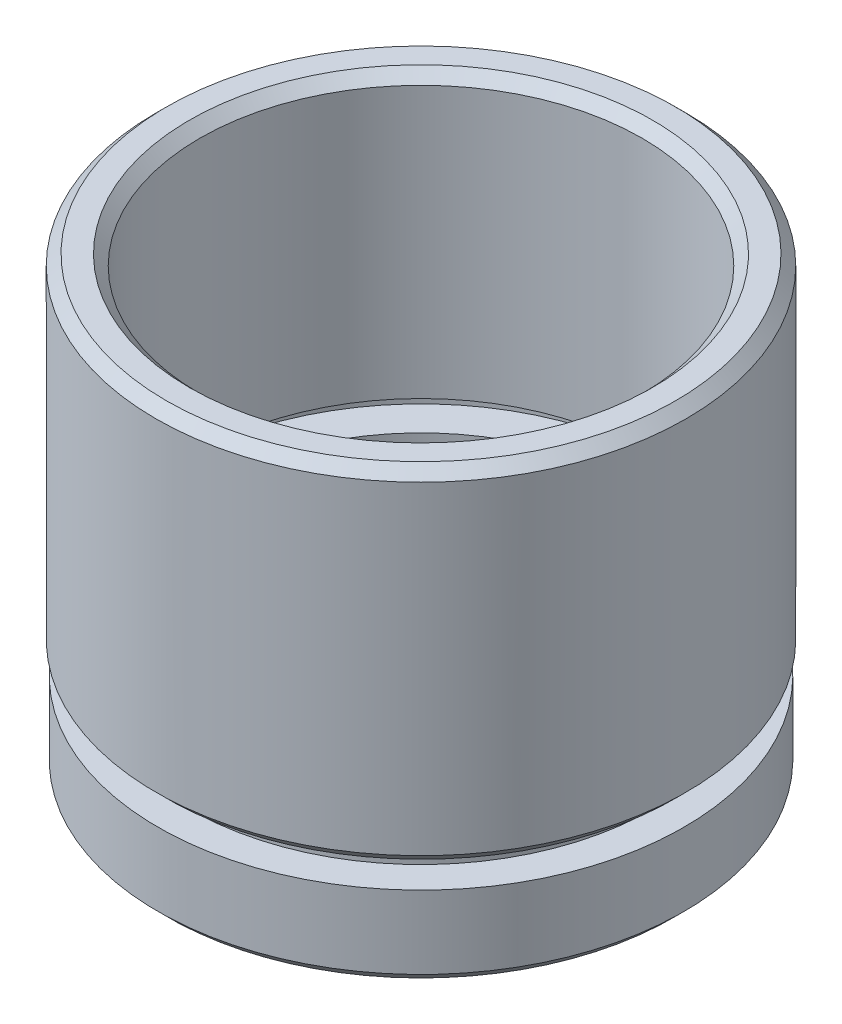
ISO-10303-21;
HEADER;
FILE_DESCRIPTION(('STEP AP214'),'2;1');
FILE_NAME('part.step','',(''),(''),'','','');
FILE_SCHEMA(('AUTOMOTIVE_DESIGN { 1 0 10303 214 1 1 1 1 }'));
ENDSEC;
DATA;
#1=APPLICATION_CONTEXT('core data for automotive mechanical design processes');
#2=APPLICATION_PROTOCOL_DEFINITION('international standard','automotive_design',2000,#1);
#3=PRODUCT_CONTEXT('',#1,'mechanical');
#4=PRODUCT('Part','Part','',(#3));
#5=PRODUCT_RELATED_PRODUCT_CATEGORY('part','',(#4));
#6=PRODUCT_DEFINITION_FORMATION('','',#4);
#7=PRODUCT_DEFINITION_CONTEXT('part definition',#1,'design');
#8=PRODUCT_DEFINITION('design','',#6,#7);
#9=PRODUCT_DEFINITION_SHAPE('','',#8);
#10=(LENGTH_UNIT() NAMED_UNIT(*) SI_UNIT(.MILLI.,.METRE.));
#11=(NAMED_UNIT(*) PLANE_ANGLE_UNIT() SI_UNIT($,.RADIAN.));
#12=(NAMED_UNIT(*) SI_UNIT($,.STERADIAN.) SOLID_ANGLE_UNIT());
#13=UNCERTAINTY_MEASURE_WITH_UNIT(LENGTH_MEASURE(1.E-05),#10,'distance_accuracy_value','');
#14=(GEOMETRIC_REPRESENTATION_CONTEXT(3) GLOBAL_UNCERTAINTY_ASSIGNED_CONTEXT((#13)) GLOBAL_UNIT_ASSIGNED_CONTEXT((#10,
#11,#12)) REPRESENTATION_CONTEXT('',''));
#15=CARTESIAN_POINT('',(0.,0.,0.));
#16=DIRECTION('',(0.,0.,1.));
#17=DIRECTION('',(1.,0.,0.));
#18=AXIS2_PLACEMENT_3D('',#15,#16,#17);
#19=CARTESIAN_POINT('',(0.,0.,0.));
#20=DIRECTION('',(0.,-1.,0.));
#21=DIRECTION('',(0.,0.,-1.));
#22=AXIS2_PLACEMENT_3D('',#19,#20,#21);
#23=CYLINDRICAL_SURFACE('',#22,9.25);
#24=CARTESIAN_POINT('',(0.,0.,0.));
#25=DIRECTION('',(0.,-1.,0.));
#26=DIRECTION('',(0.,0.,-1.));
#27=AXIS2_PLACEMENT_3D('',#24,#25,#26);
#28=CIRCLE('',#27,9.25);
#29=CARTESIAN_POINT('',(0.,0.,-9.25));
#30=VERTEX_POINT('',#29);
#31=EDGE_CURVE('E67',#30,#30,#28,.T.);
#32=ORIENTED_EDGE('',*,*,#31,.T.);
#33=EDGE_LOOP('',(#32));
#34=FACE_BOUND('',#33,.T.);
#35=CARTESIAN_POINT('',(0.,2.,0.));
#36=DIRECTION('',(0.,-1.,0.));
#37=DIRECTION('',(0.,0.,-1.));
#38=AXIS2_PLACEMENT_3D('',#35,#36,#37);
#39=CIRCLE('',#38,9.25);
#40=CARTESIAN_POINT('',(0.,2.,-9.25));
#41=VERTEX_POINT('',#40);
#42=EDGE_CURVE('E94',#41,#41,#39,.T.);
#43=ORIENTED_EDGE('',*,*,#42,.F.);
#44=EDGE_LOOP('',(#43));
#45=FACE_BOUND('',#44,.T.);
#46=ADVANCED_FACE('F35',(#34,#45),#23,.F.);
#47=CARTESIAN_POINT('',(9.25,0.,0.));
#48=DIRECTION('',(0.,-1.,0.));
#49=DIRECTION('',(0.,0.,-1.));
#50=AXIS2_PLACEMENT_3D('',#47,#48,#49);
#51=PLANE('',#50);
#52=CARTESIAN_POINT('',(0.,0.,0.));
#53=DIRECTION('',(0.,-1.,0.));
#54=DIRECTION('',(0.,0.,-1.));
#55=AXIS2_PLACEMENT_3D('',#52,#53,#54);
#56=CIRCLE('',#55,12.1);
#57=CARTESIAN_POINT('',(0.,0.,-12.1));
#58=VERTEX_POINT('',#57);
#59=EDGE_CURVE('E42',#58,#58,#56,.T.);
#60=ORIENTED_EDGE('',*,*,#59,.T.);
#61=EDGE_LOOP('',(#60));
#62=FACE_BOUND('',#61,.T.);
#63=ORIENTED_EDGE('',*,*,#31,.F.);
#64=EDGE_LOOP('',(#63));
#65=FACE_BOUND('',#64,.T.);
#66=ADVANCED_FACE('F102',(#62,#65),#51,.T.);
#67=CARTESIAN_POINT('',(0.,0.,0.));
#68=DIRECTION('',(0.,-1.,0.));
#69=DIRECTION('',(0.,0.,-1.));
#70=AXIS2_PLACEMENT_3D('',#67,#68,#69);
#71=CYLINDRICAL_SURFACE('',#70,12.6);
#72=CARTESIAN_POINT('',(0.,0.500000000000007,0.));
#73=DIRECTION('',(0.,-1.,0.));
#74=DIRECTION('',(0.,0.,-1.));
#75=AXIS2_PLACEMENT_3D('',#72,#73,#74);
#76=CIRCLE('',#75,12.6);
#77=CARTESIAN_POINT('',(0.,0.500000000000007,-12.6));
#78=VERTEX_POINT('',#77);
#79=EDGE_CURVE('E10',#78,#78,#76,.F.);
#80=ORIENTED_EDGE('',*,*,#79,.T.);
#81=EDGE_LOOP('',(#80));
#82=FACE_BOUND('',#81,.T.);
#83=CARTESIAN_POINT('',(0.,4.,0.));
#84=DIRECTION('',(0.,-1.,0.));
#85=DIRECTION('',(0.,0.,-1.));
#86=AXIS2_PLACEMENT_3D('',#83,#84,#85);
#87=CIRCLE('',#86,12.6);
#88=CARTESIAN_POINT('',(0.,4.,-12.6));
#89=VERTEX_POINT('',#88);
#90=EDGE_CURVE('E70',#89,#89,#87,.T.);
#91=ORIENTED_EDGE('',*,*,#90,.T.);
#92=EDGE_LOOP('',(#91));
#93=FACE_BOUND('',#92,.T.);
#94=ADVANCED_FACE('F108',(#82,#93),#71,.T.);
#95=CARTESIAN_POINT('',(12.6,4.,0.));
#96=DIRECTION('',(0.,1.,0.));
#97=DIRECTION('',(0.,0.,1.));
#98=AXIS2_PLACEMENT_3D('',#95,#96,#97);
#99=PLANE('',#98);
#100=CARTESIAN_POINT('',(0.,4.,0.));
#101=DIRECTION('',(0.,-1.,0.));
#102=DIRECTION('',(0.,0.,-1.));
#103=AXIS2_PLACEMENT_3D('',#100,#101,#102);
#104=CIRCLE('',#103,11.1);
#105=CARTESIAN_POINT('',(0.,4.,-11.1));
#106=VERTEX_POINT('',#105);
#107=EDGE_CURVE('E73',#106,#106,#104,.T.);
#108=ORIENTED_EDGE('',*,*,#107,.T.);
#109=EDGE_LOOP('',(#108));
#110=FACE_BOUND('',#109,.T.);
#111=ORIENTED_EDGE('',*,*,#90,.F.);
#112=EDGE_LOOP('',(#111));
#113=FACE_BOUND('',#112,.T.);
#114=ADVANCED_FACE('F140',(#110,#113),#99,.T.);
#115=CARTESIAN_POINT('',(0.,0.,0.));
#116=DIRECTION('',(0.,-1.,0.));
#117=DIRECTION('',(0.,0.,-1.));
#118=AXIS2_PLACEMENT_3D('',#115,#116,#117);
#119=CYLINDRICAL_SURFACE('',#118,11.1);
#120=CARTESIAN_POINT('',(0.,5.,0.));
#121=DIRECTION('',(0.,-1.,0.));
#122=DIRECTION('',(0.,0.,-1.));
#123=AXIS2_PLACEMENT_3D('',#120,#121,#122);
#124=CIRCLE('',#123,11.1);
#125=CARTESIAN_POINT('',(0.,5.,-11.1));
#126=VERTEX_POINT('',#125);
#127=EDGE_CURVE('E76',#126,#126,#124,.T.);
#128=ORIENTED_EDGE('',*,*,#127,.T.);
#129=EDGE_LOOP('',(#128));
#130=FACE_BOUND('',#129,.T.);
#131=ORIENTED_EDGE('',*,*,#107,.F.);
#132=EDGE_LOOP('',(#131));
#133=FACE_BOUND('',#132,.T.);
#134=ADVANCED_FACE('F134',(#130,#133),#119,.T.);
#135=CARTESIAN_POINT('',(11.1,5.,0.));
#136=DIRECTION('',(0.,-1.,0.));
#137=DIRECTION('',(0.,0.,-1.));
#138=AXIS2_PLACEMENT_3D('',#135,#136,#137);
#139=PLANE('',#138);
#140=CARTESIAN_POINT('',(0.,5.,0.));
#141=DIRECTION('',(0.,-1.,0.));
#142=DIRECTION('',(0.,0.,-1.));
#143=AXIS2_PLACEMENT_3D('',#140,#141,#142);
#144=CIRCLE('',#143,12.2);
#145=CARTESIAN_POINT('',(0.,5.,-12.2));
#146=VERTEX_POINT('',#145);
#147=EDGE_CURVE('E46',#146,#146,#144,.T.);
#148=ORIENTED_EDGE('',*,*,#147,.T.);
#149=EDGE_LOOP('',(#148));
#150=FACE_BOUND('',#149,.T.);
#151=ORIENTED_EDGE('',*,*,#127,.F.);
#152=EDGE_LOOP('',(#151));
#153=FACE_BOUND('',#152,.T.);
#154=ADVANCED_FACE('F130',(#150,#153),#139,.T.);
#155=CARTESIAN_POINT('',(0.,0.,0.));
#156=DIRECTION('',(0.,-1.,0.));
#157=DIRECTION('',(0.,0.,-1.));
#158=AXIS2_PLACEMENT_3D('',#155,#156,#157);
#159=CYLINDRICAL_SURFACE('',#158,12.7);
#160=CARTESIAN_POINT('',(0.,21.,0.));
#161=DIRECTION('',(0.,1.,0.));
#162=DIRECTION('',(0.,0.,1.));
#163=AXIS2_PLACEMENT_3D('',#160,#161,#162);
#164=CIRCLE('',#163,12.7);
#165=CARTESIAN_POINT('',(0.,21.,12.7));
#166=VERTEX_POINT('',#165);
#167=EDGE_CURVE('E50',#166,#166,#164,.F.);
#168=ORIENTED_EDGE('',*,*,#167,.T.);
#169=EDGE_LOOP('',(#168));
#170=FACE_BOUND('',#169,.T.);
#171=CARTESIAN_POINT('',(0.,5.5,0.));
#172=DIRECTION('',(0.,-1.,0.));
#173=DIRECTION('',(0.,0.,-1.));
#174=AXIS2_PLACEMENT_3D('',#171,#172,#173);
#175=CIRCLE('',#174,12.7);
#176=CARTESIAN_POINT('',(0.,5.5,-12.7));
#177=VERTEX_POINT('',#176);
#178=EDGE_CURVE('E55',#177,#177,#175,.F.);
#179=ORIENTED_EDGE('',*,*,#178,.T.);
#180=EDGE_LOOP('',(#179));
#181=FACE_BOUND('',#180,.T.);
#182=ADVANCED_FACE('F133',(#170,#181),#159,.T.);
#183=CARTESIAN_POINT('',(12.7,21.5,0.));
#184=DIRECTION('',(0.,1.,0.));
#185=DIRECTION('',(0.,0.,1.));
#186=AXIS2_PLACEMENT_3D('',#183,#184,#185);
#187=PLANE('',#186);
#188=CARTESIAN_POINT('',(0.,21.5,0.));
#189=DIRECTION('',(0.,1.,0.));
#190=DIRECTION('',(0.,0.,1.));
#191=AXIS2_PLACEMENT_3D('',#188,#189,#190);
#192=CIRCLE('',#191,11.1);
#193=CARTESIAN_POINT('',(0.,21.5,11.1));
#194=VERTEX_POINT('',#193);
#195=EDGE_CURVE('E61',#194,#194,#192,.F.);
#196=ORIENTED_EDGE('',*,*,#195,.T.);
#197=EDGE_LOOP('',(#196));
#198=FACE_BOUND('',#197,.T.);
#199=CARTESIAN_POINT('',(0.,21.5,0.));
#200=DIRECTION('',(0.,1.,0.));
#201=DIRECTION('',(0.,0.,1.));
#202=AXIS2_PLACEMENT_3D('',#199,#200,#201);
#203=CIRCLE('',#202,12.2);
#204=CARTESIAN_POINT('',(0.,21.5,12.2));
#205=VERTEX_POINT('',#204);
#206=EDGE_CURVE('E64',#205,#205,#203,.T.);
#207=ORIENTED_EDGE('',*,*,#206,.T.);
#208=EDGE_LOOP('',(#207));
#209=FACE_BOUND('',#208,.T.);
#210=ADVANCED_FACE('F155',(#198,#209),#187,.T.);
#211=CARTESIAN_POINT('',(0.,0.,0.));
#212=DIRECTION('',(0.,-1.,0.));
#213=DIRECTION('',(0.,0.,-1.));
#214=AXIS2_PLACEMENT_3D('',#211,#212,#213);
#215=CYLINDRICAL_SURFACE('',#214,10.6);
#216=CARTESIAN_POINT('',(0.,21.,0.));
#217=DIRECTION('',(0.,1.,0.));
#218=DIRECTION('',(0.,0.,1.));
#219=AXIS2_PLACEMENT_3D('',#216,#217,#218);
#220=CIRCLE('',#219,10.6);
#221=CARTESIAN_POINT('',(0.,21.,10.6));
#222=VERTEX_POINT('',#221);
#223=EDGE_CURVE('E58',#222,#222,#220,.T.);
#224=ORIENTED_EDGE('',*,*,#223,.T.);
#225=EDGE_LOOP('',(#224));
#226=FACE_BOUND('',#225,.T.);
#227=CARTESIAN_POINT('',(0.,8.,0.));
#228=DIRECTION('',(0.,-1.,0.));
#229=DIRECTION('',(0.,0.,-1.));
#230=AXIS2_PLACEMENT_3D('',#227,#228,#229);
#231=CIRCLE('',#230,10.6);
#232=CARTESIAN_POINT('',(0.,8.,-10.6));
#233=VERTEX_POINT('',#232);
#234=EDGE_CURVE('E79',#233,#233,#231,.T.);
#235=ORIENTED_EDGE('',*,*,#234,.T.);
#236=EDGE_LOOP('',(#235));
#237=FACE_BOUND('',#236,.T.);
#238=ADVANCED_FACE('F159',(#226,#237),#215,.F.);
#239=CARTESIAN_POINT('',(10.6,8.,0.));
#240=DIRECTION('',(0.,-1.,0.));
#241=DIRECTION('',(0.,0.,-1.));
#242=AXIS2_PLACEMENT_3D('',#239,#240,#241);
#243=PLANE('',#242);
#244=CARTESIAN_POINT('',(0.,8.,0.));
#245=DIRECTION('',(0.,-1.,0.));
#246=DIRECTION('',(0.,0.,-1.));
#247=AXIS2_PLACEMENT_3D('',#244,#245,#246);
#248=CIRCLE('',#247,11.7);
#249=CARTESIAN_POINT('',(0.,8.,-11.7));
#250=VERTEX_POINT('',#249);
#251=EDGE_CURVE('E82',#250,#250,#248,.T.);
#252=ORIENTED_EDGE('',*,*,#251,.T.);
#253=EDGE_LOOP('',(#252));
#254=FACE_BOUND('',#253,.T.);
#255=ORIENTED_EDGE('',*,*,#234,.F.);
#256=EDGE_LOOP('',(#255));
#257=FACE_BOUND('',#256,.T.);
#258=ADVANCED_FACE('F163',(#254,#257),#243,.T.);
#259=CARTESIAN_POINT('',(0.,0.,0.));
#260=DIRECTION('',(0.,-1.,0.));
#261=DIRECTION('',(0.,0.,-1.));
#262=AXIS2_PLACEMENT_3D('',#259,#260,#261);
#263=CYLINDRICAL_SURFACE('',#262,11.7);
#264=CARTESIAN_POINT('',(0.,7.,0.));
#265=DIRECTION('',(0.,-1.,0.));
#266=DIRECTION('',(0.,0.,-1.));
#267=AXIS2_PLACEMENT_3D('',#264,#265,#266);
#268=CIRCLE('',#267,11.7);
#269=CARTESIAN_POINT('',(0.,7.,-11.7));
#270=VERTEX_POINT('',#269);
#271=EDGE_CURVE('E85',#270,#270,#268,.T.);
#272=ORIENTED_EDGE('',*,*,#271,.T.);
#273=EDGE_LOOP('',(#272));
#274=FACE_BOUND('',#273,.T.);
#275=ORIENTED_EDGE('',*,*,#251,.F.);
#276=EDGE_LOOP('',(#275));
#277=FACE_BOUND('',#276,.T.);
#278=ADVANCED_FACE('F167',(#274,#277),#263,.F.);
#279=CARTESIAN_POINT('',(11.7,7.,0.));
#280=DIRECTION('',(0.,1.,0.));
#281=DIRECTION('',(0.,0.,1.));
#282=AXIS2_PLACEMENT_3D('',#279,#280,#281);
#283=PLANE('',#282);
#284=CARTESIAN_POINT('',(0.,7.,0.));
#285=DIRECTION('',(0.,-1.,0.));
#286=DIRECTION('',(0.,0.,-1.));
#287=AXIS2_PLACEMENT_3D('',#284,#285,#286);
#288=CIRCLE('',#287,10.);
#289=CARTESIAN_POINT('',(0.,7.,-10.));
#290=VERTEX_POINT('',#289);
#291=EDGE_CURVE('E88',#290,#290,#288,.T.);
#292=ORIENTED_EDGE('',*,*,#291,.T.);
#293=EDGE_LOOP('',(#292));
#294=FACE_BOUND('',#293,.T.);
#295=ORIENTED_EDGE('',*,*,#271,.F.);
#296=EDGE_LOOP('',(#295));
#297=FACE_BOUND('',#296,.T.);
#298=ADVANCED_FACE('F171',(#294,#297),#283,.T.);
#299=CARTESIAN_POINT('',(0.,0.,0.));
#300=DIRECTION('',(0.,-1.,0.));
#301=DIRECTION('',(0.,0.,-1.));
#302=AXIS2_PLACEMENT_3D('',#299,#300,#301);
#303=CYLINDRICAL_SURFACE('',#302,10.);
#304=CARTESIAN_POINT('',(0.,2.,0.));
#305=DIRECTION('',(0.,-1.,0.));
#306=DIRECTION('',(0.,0.,-1.));
#307=AXIS2_PLACEMENT_3D('',#304,#305,#306);
#308=CIRCLE('',#307,10.);
#309=CARTESIAN_POINT('',(0.,2.,-10.));
#310=VERTEX_POINT('',#309);
#311=EDGE_CURVE('E91',#310,#310,#308,.T.);
#312=ORIENTED_EDGE('',*,*,#311,.T.);
#313=EDGE_LOOP('',(#312));
#314=FACE_BOUND('',#313,.T.);
#315=ORIENTED_EDGE('',*,*,#291,.F.);
#316=EDGE_LOOP('',(#315));
#317=FACE_BOUND('',#316,.T.);
#318=ADVANCED_FACE('F175',(#314,#317),#303,.F.);
#319=CARTESIAN_POINT('',(10.,2.,0.));
#320=DIRECTION('',(0.,1.,0.));
#321=DIRECTION('',(0.,0.,1.));
#322=AXIS2_PLACEMENT_3D('',#319,#320,#321);
#323=PLANE('',#322);
#324=ORIENTED_EDGE('',*,*,#42,.T.);
#325=EDGE_LOOP('',(#324));
#326=FACE_BOUND('',#325,.T.);
#327=ORIENTED_EDGE('',*,*,#311,.F.);
#328=EDGE_LOOP('',(#327));
#329=FACE_BOUND('',#328,.T.);
#330=ADVANCED_FACE('F98',(#326,#329),#323,.T.);
#331=CARTESIAN_POINT('',(0.,21.5,0.));
#332=DIRECTION('',(0.,1.,0.));
#333=DIRECTION('',(0.,0.,1.));
#334=AXIS2_PLACEMENT_3D('',#331,#332,#333);
#335=CONICAL_SURFACE('',#334,11.1,0.785398163397445);
#336=ORIENTED_EDGE('',*,*,#223,.F.);
#337=EDGE_LOOP('',(#336));
#338=FACE_BOUND('',#337,.T.);
#339=ORIENTED_EDGE('',*,*,#195,.F.);
#340=EDGE_LOOP('',(#339));
#341=FACE_BOUND('',#340,.T.);
#342=ADVANCED_FACE('F112',(#338,#341),#335,.F.);
#343=CARTESIAN_POINT('',(0.,21.,0.));
#344=DIRECTION('',(0.,-1.,0.));
#345=DIRECTION('',(0.,0.,-1.));
#346=AXIS2_PLACEMENT_3D('',#343,#344,#345);
#347=CONICAL_SURFACE('',#346,12.7,0.785398163397454);
#348=ORIENTED_EDGE('',*,*,#206,.F.);
#349=EDGE_LOOP('',(#348));
#350=FACE_BOUND('',#349,.T.);
#351=ORIENTED_EDGE('',*,*,#167,.F.);
#352=EDGE_LOOP('',(#351));
#353=FACE_BOUND('',#352,.T.);
#354=ADVANCED_FACE('F115',(#350,#353),#347,.T.);
#355=CARTESIAN_POINT('',(0.,5.,0.));
#356=DIRECTION('',(0.,1.,0.));
#357=DIRECTION('',(0.,0.,1.));
#358=AXIS2_PLACEMENT_3D('',#355,#356,#357);
#359=CONICAL_SURFACE('',#358,12.2,0.785398163397447);
#360=ORIENTED_EDGE('',*,*,#178,.F.);
#361=EDGE_LOOP('',(#360));
#362=FACE_BOUND('',#361,.T.);
#363=ORIENTED_EDGE('',*,*,#147,.F.);
#364=EDGE_LOOP('',(#363));
#365=FACE_BOUND('',#364,.T.);
#366=ADVANCED_FACE('F118',(#362,#365),#359,.T.);
#367=CARTESIAN_POINT('',(0.,0.,0.));
#368=DIRECTION('',(0.,1.,0.));
#369=DIRECTION('',(0.,0.,1.));
#370=AXIS2_PLACEMENT_3D('',#367,#368,#369);
#371=CONICAL_SURFACE('',#370,12.1,0.785398163397447);
#372=ORIENTED_EDGE('',*,*,#79,.F.);
#373=EDGE_LOOP('',(#372));
#374=FACE_BOUND('',#373,.T.);
#375=ORIENTED_EDGE('',*,*,#59,.F.);
#376=EDGE_LOOP('',(#375));
#377=FACE_BOUND('',#376,.T.);
#378=ADVANCED_FACE('F37',(#374,#377),#371,.T.);
#379=CLOSED_SHELL('',(#46,#66,#94,#114,#134,#154,#182,#210,#238,#258,#278,#298,#318,#330,#342,
#354,#366,#378));
#380=MANIFOLD_SOLID_BREP('B2',#379);
#381=ADVANCED_BREP_SHAPE_REPRESENTATION('',(#18,#380),#14);
#382=SHAPE_DEFINITION_REPRESENTATION(#9,#381);
ENDSEC;
END-ISO-10303-21;
